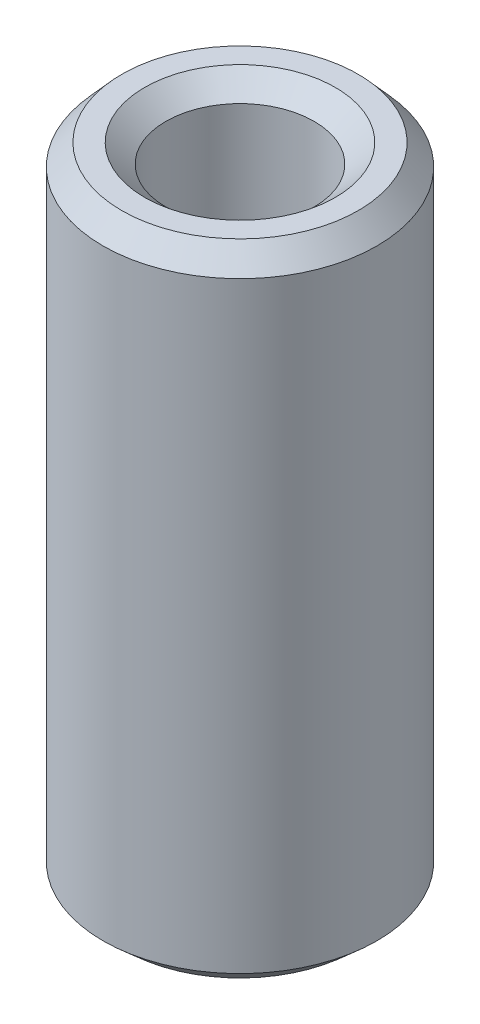
ISO-10303-21;
HEADER;
FILE_DESCRIPTION(('STEP AP214'),'2;1');
FILE_NAME('part.step','',(''),(''),'','','');
FILE_SCHEMA(('AUTOMOTIVE_DESIGN { 1 0 10303 214 1 1 1 1 }'));
ENDSEC;
DATA;
#1=APPLICATION_CONTEXT('core data for automotive mechanical design processes');
#2=APPLICATION_PROTOCOL_DEFINITION('international standard','automotive_design',2000,#1);
#3=PRODUCT_CONTEXT('',#1,'mechanical');
#4=PRODUCT('Part','Part','',(#3));
#5=PRODUCT_RELATED_PRODUCT_CATEGORY('part','',(#4));
#6=PRODUCT_DEFINITION_FORMATION('','',#4);
#7=PRODUCT_DEFINITION_CONTEXT('part definition',#1,'design');
#8=PRODUCT_DEFINITION('design','',#6,#7);
#9=PRODUCT_DEFINITION_SHAPE('','',#8);
#10=(LENGTH_UNIT() NAMED_UNIT(*) SI_UNIT(.MILLI.,.METRE.));
#11=(NAMED_UNIT(*) PLANE_ANGLE_UNIT() SI_UNIT($,.RADIAN.));
#12=(NAMED_UNIT(*) SI_UNIT($,.STERADIAN.) SOLID_ANGLE_UNIT());
#13=UNCERTAINTY_MEASURE_WITH_UNIT(LENGTH_MEASURE(1.E-05),#10,'distance_accuracy_value','');
#14=(GEOMETRIC_REPRESENTATION_CONTEXT(3) GLOBAL_UNCERTAINTY_ASSIGNED_CONTEXT((#13)) GLOBAL_UNIT_ASSIGNED_CONTEXT((#10,
#11,#12)) REPRESENTATION_CONTEXT('',''));
#15=CARTESIAN_POINT('',(0.,0.,0.));
#16=DIRECTION('',(0.,0.,1.));
#17=DIRECTION('',(1.,0.,0.));
#18=AXIS2_PLACEMENT_3D('',#15,#16,#17);
#19=CARTESIAN_POINT('',(0.,93.7116540600208,0.));
#20=DIRECTION('',(0.,-1.,0.));
#21=DIRECTION('',(0.,0.,-1.));
#22=AXIS2_PLACEMENT_3D('',#19,#20,#21);
#23=CYLINDRICAL_SURFACE('',#22,20.);
#24=CARTESIAN_POINT('',(0.,2.74448463937486,0.));
#25=DIRECTION('',(0.,1.,0.));
#26=DIRECTION('',(0.,0.,1.));
#27=AXIS2_PLACEMENT_3D('',#24,#25,#26);
#28=CIRCLE('',#27,20.);
#29=CARTESIAN_POINT('',(0.,2.74448463937486,20.));
#30=VERTEX_POINT('',#29);
#31=EDGE_CURVE('E10',#30,#30,#28,.T.);
#32=ORIENTED_EDGE('',*,*,#31,.T.);
#33=EDGE_LOOP('',(#32));
#34=FACE_BOUND('',#33,.T.);
#35=CARTESIAN_POINT('',(0.,90.6195021593534,0.));
#36=DIRECTION('',(0.,1.,0.));
#37=DIRECTION('',(0.,0.,1.));
#38=AXIS2_PLACEMENT_3D('',#35,#36,#37);
#39=CIRCLE('',#38,20.);
#40=CARTESIAN_POINT('',(0.,90.6195021593534,20.));
#41=VERTEX_POINT('',#40);
#42=EDGE_CURVE('E50',#41,#41,#39,.F.);
#43=ORIENTED_EDGE('',*,*,#42,.T.);
#44=EDGE_LOOP('',(#43));
#45=FACE_BOUND('',#44,.T.);
#46=ADVANCED_FACE('F39',(#34,#45),#23,.T.);
#47=CARTESIAN_POINT('',(0.,93.7116540600208,0.));
#48=DIRECTION('',(0.,1.,0.));
#49=DIRECTION('',(0.,0.,1.));
#50=AXIS2_PLACEMENT_3D('',#47,#48,#49);
#51=PLANE('',#50);
#52=CARTESIAN_POINT('',(0.,93.7116540600208,0.));
#53=DIRECTION('',(0.,1.,0.));
#54=DIRECTION('',(0.,0.,1.));
#55=AXIS2_PLACEMENT_3D('',#52,#53,#54);
#56=CIRCLE('',#55,13.9219117868472);
#57=CARTESIAN_POINT('',(0.,93.7116540600208,13.9219117868472));
#58=VERTEX_POINT('',#57);
#59=EDGE_CURVE('E58',#58,#58,#56,.F.);
#60=ORIENTED_EDGE('',*,*,#59,.T.);
#61=EDGE_LOOP('',(#60));
#62=FACE_BOUND('',#61,.T.);
#63=CARTESIAN_POINT('',(0.,93.7116540600208,0.));
#64=DIRECTION('',(0.,1.,0.));
#65=DIRECTION('',(0.,0.,1.));
#66=AXIS2_PLACEMENT_3D('',#63,#64,#65);
#67=CIRCLE('',#66,17.2555153606251);
#68=CARTESIAN_POINT('',(0.,93.7116540600208,17.2555153606251));
#69=VERTEX_POINT('',#68);
#70=EDGE_CURVE('E61',#69,#69,#67,.T.);
#71=ORIENTED_EDGE('',*,*,#70,.T.);
#72=EDGE_LOOP('',(#71));
#73=FACE_BOUND('',#72,.T.);
#74=ADVANCED_FACE('F88',(#62,#73),#51,.T.);
#75=CARTESIAN_POINT('',(0.,0.,0.));
#76=DIRECTION('',(0.,1.,0.));
#77=DIRECTION('',(0.,0.,1.));
#78=AXIS2_PLACEMENT_3D('',#75,#76,#77);
#79=PLANE('',#78);
#80=CARTESIAN_POINT('',(0.,0.,0.));
#81=DIRECTION('',(0.,1.,0.));
#82=DIRECTION('',(0.,0.,1.));
#83=AXIS2_PLACEMENT_3D('',#80,#81,#82);
#84=CIRCLE('',#83,13.5742445255546);
#85=CARTESIAN_POINT('',(0.,0.,-13.5742445255546));
#86=VERTEX_POINT('',#85);
#87=EDGE_CURVE('E51',#86,#86,#84,.T.);
#88=ORIENTED_EDGE('',*,*,#87,.T.);
#89=EDGE_LOOP('',(#88));
#90=FACE_BOUND('',#89,.T.);
#91=CARTESIAN_POINT('',(0.,0.,0.));
#92=DIRECTION('',(0.,1.,0.));
#93=DIRECTION('',(0.,0.,1.));
#94=AXIS2_PLACEMENT_3D('',#91,#92,#93);
#95=CIRCLE('',#94,16.9078480993326);
#96=CARTESIAN_POINT('',(0.,0.,16.9078480993326));
#97=VERTEX_POINT('',#96);
#98=EDGE_CURVE('E54',#97,#97,#95,.F.);
#99=ORIENTED_EDGE('',*,*,#98,.T.);
#100=EDGE_LOOP('',(#99));
#101=FACE_BOUND('',#100,.T.);
#102=ADVANCED_FACE('F83',(#90,#101),#79,.F.);
#103=CARTESIAN_POINT('',(0.,93.7116540600208,0.));
#104=DIRECTION('',(0.,-1.,0.));
#105=DIRECTION('',(0.,0.,-1.));
#106=AXIS2_PLACEMENT_3D('',#103,#104,#105);
#107=CYLINDRICAL_SURFACE('',#106,10.8297598861798);
#108=CARTESIAN_POINT('',(0.,90.9671694206459,0.));
#109=DIRECTION('',(0.,1.,0.));
#110=DIRECTION('',(0.,0.,1.));
#111=AXIS2_PLACEMENT_3D('',#108,#109,#110);
#112=CIRCLE('',#111,10.8297598861798);
#113=CARTESIAN_POINT('',(0.,90.9671694206459,10.8297598861798));
#114=VERTEX_POINT('',#113);
#115=EDGE_CURVE('E67',#114,#114,#112,.T.);
#116=ORIENTED_EDGE('',*,*,#115,.T.);
#117=EDGE_LOOP('',(#116));
#118=FACE_BOUND('',#117,.T.);
#119=CARTESIAN_POINT('',(0.,3.09215190066736,0.));
#120=DIRECTION('',(0.,1.,0.));
#121=DIRECTION('',(0.,0.,1.));
#122=AXIS2_PLACEMENT_3D('',#119,#120,#121);
#123=CIRCLE('',#122,10.8297598861798);
#124=CARTESIAN_POINT('',(0.,3.09215190066736,-10.8297598861798));
#125=VERTEX_POINT('',#124);
#126=EDGE_CURVE('E69',#125,#125,#123,.F.);
#127=ORIENTED_EDGE('',*,*,#126,.T.);
#128=EDGE_LOOP('',(#127));
#129=FACE_BOUND('',#128,.T.);
#130=ADVANCED_FACE('F71',(#118,#129),#107,.F.);
#131=CARTESIAN_POINT('',(0.,90.9671694206459,0.));
#132=DIRECTION('',(0.,1.,0.));
#133=DIRECTION('',(0.,0.,1.));
#134=AXIS2_PLACEMENT_3D('',#131,#132,#133);
#135=CONICAL_SURFACE('',#134,10.8297598861798,0.844894234450015);
#136=ORIENTED_EDGE('',*,*,#59,.F.);
#137=EDGE_LOOP('',(#136));
#138=FACE_BOUND('',#137,.T.);
#139=ORIENTED_EDGE('',*,*,#115,.F.);
#140=EDGE_LOOP('',(#139));
#141=FACE_BOUND('',#140,.T.);
#142=ADVANCED_FACE('F77',(#138,#141),#135,.F.);
#143=CARTESIAN_POINT('',(0.,0.,0.));
#144=DIRECTION('',(0.,-1.,0.));
#145=DIRECTION('',(0.,0.,-1.));
#146=AXIS2_PLACEMENT_3D('',#143,#144,#145);
#147=CONICAL_SURFACE('',#146,13.5742445255546,0.725902092344883);
#148=CARTESIAN_POINT('',(0.,3.09215190066736,-10.8297598861798));
#149=CARTESIAN_POINT('',(0.,3.05994198503541,-10.85834826784));
#150=CARTESIAN_POINT('',(0.,3.02773206940346,-10.8869366495001));
#151=CARTESIAN_POINT('',(0.,2.96331223813955,-10.9441134128204));
#152=CARTESIAN_POINT('',(0.,2.9311023225076,-10.9727017944806));
#153=CARTESIAN_POINT('',(0.,2.8666824912437,-11.0298785578009));
#154=CARTESIAN_POINT('',(0.,2.83447257561175,-11.058466939461));
#155=CARTESIAN_POINT('',(0.,2.77005274434784,-11.1156437027814));
#156=CARTESIAN_POINT('',(0.,2.73784282871589,-11.1442320844415));
#157=CARTESIAN_POINT('',(0.,2.67342299745199,-11.2014088477618));
#158=CARTESIAN_POINT('',(0.,2.64121308182004,-11.229997229422));
#159=CARTESIAN_POINT('',(0.,2.57679325055613,-11.2871739927423));
#160=CARTESIAN_POINT('',(0.,2.54458333492418,-11.3157623744024));
#161=CARTESIAN_POINT('',(0.,2.48016350366028,-11.3729391377227));
#162=CARTESIAN_POINT('',(0.,2.44795358802833,-11.4015275193829));
#163=CARTESIAN_POINT('',(0.,2.38353375676442,-11.4587042827032));
#164=CARTESIAN_POINT('',(0.,2.35132384113247,-11.4872926643634));
#165=CARTESIAN_POINT('',(0.,2.28690400986857,-11.5444694276837));
#166=CARTESIAN_POINT('',(0.,2.25469409423662,-11.5730578093438));
#167=CARTESIAN_POINT('',(0.,2.19027426297271,-11.6302345726641));
#168=CARTESIAN_POINT('',(0.,2.15806434734076,-11.6588229543243));
#169=CARTESIAN_POINT('',(0.,2.09364451607686,-11.7159997176446));
#170=CARTESIAN_POINT('',(0.,2.06143460044491,-11.7445880993048));
#171=CARTESIAN_POINT('',(0.,1.997014769181,-11.8017648626251));
#172=CARTESIAN_POINT('',(0.,1.96480485354905,-11.8303532442852));
#173=CARTESIAN_POINT('',(0.,1.90038502228515,-11.8875300076055));
#174=CARTESIAN_POINT('',(0.,1.8681751066532,-11.9161183892657));
#175=CARTESIAN_POINT('',(0.,1.80375527538929,-11.973295152586));
#176=CARTESIAN_POINT('',(0.,1.77154535975734,-12.0018835342461));
#177=CARTESIAN_POINT('',(0.,1.70712552849344,-12.0590602975665));
#178=CARTESIAN_POINT('',(0.,1.67491561286149,-12.0876486792266));
#179=CARTESIAN_POINT('',(0.,1.61049578159758,-12.1448254425469));
#180=CARTESIAN_POINT('',(0.,1.57828586596563,-12.1734138242071));
#181=CARTESIAN_POINT('',(0.,1.51386603470173,-12.2305905875274));
#182=CARTESIAN_POINT('',(0.,1.48165611906978,-12.2591789691875));
#183=CARTESIAN_POINT('',(0.,1.41723628780587,-12.3163557325078));
#184=CARTESIAN_POINT('',(0.,1.38502637217392,-12.344944114168));
#185=CARTESIAN_POINT('',(0.,1.32060654091002,-12.4021208774883));
#186=CARTESIAN_POINT('',(0.,1.28839662527807,-12.4307092591485));
#187=CARTESIAN_POINT('',(0.,1.22397679401416,-12.4878860224688));
#188=CARTESIAN_POINT('',(0.,1.19176687838221,-12.5164744041289));
#189=CARTESIAN_POINT('',(0.,1.12734704711831,-12.5736511674492));
#190=CARTESIAN_POINT('',(0.,1.09513713148636,-12.6022395491094));
#191=CARTESIAN_POINT('',(0.,1.03071730022245,-12.6594163124297));
#192=CARTESIAN_POINT('',(0.,0.998507384590502,-12.6880046940899));
#193=CARTESIAN_POINT('',(0.,0.934087553326599,-12.7451814574102));
#194=CARTESIAN_POINT('',(0.,0.901877637694647,-12.7737698390703));
#195=CARTESIAN_POINT('',(0.,0.837457806430744,-12.8309466023906));
#196=CARTESIAN_POINT('',(0.,0.805247890798792,-12.8595349840508));
#197=CARTESIAN_POINT('',(0.,0.740828059534889,-12.9167117473711));
#198=CARTESIAN_POINT('',(0.,0.708618143902937,-12.9453001290312));
#199=CARTESIAN_POINT('',(0.,0.644198312639033,-13.0024768923516));
#200=CARTESIAN_POINT('',(0.,0.611988397007082,-13.0310652740117));
#201=CARTESIAN_POINT('',(0.,0.547568565743179,-13.088242037332));
#202=CARTESIAN_POINT('',(0.,0.515358650111227,-13.1168304189922));
#203=CARTESIAN_POINT('',(0.,0.450938818847324,-13.1740071823125));
#204=CARTESIAN_POINT('',(0.,0.418728903215372,-13.2025955639726));
#205=CARTESIAN_POINT('',(0.,0.354309071951468,-13.2597723272929));
#206=CARTESIAN_POINT('',(0.,0.322099156319517,-13.2883607089531));
#207=CARTESIAN_POINT('',(0.,0.257679325055613,-13.3455374722734));
#208=CARTESIAN_POINT('',(0.,0.225469409423662,-13.3741258539336));
#209=CARTESIAN_POINT('',(0.,0.161049578159759,-13.4313026172539));
#210=CARTESIAN_POINT('',(0.,0.128839662527807,-13.459890998914));
#211=CARTESIAN_POINT('',(0.,0.0644198312639032,-13.5170677622343));
#212=CARTESIAN_POINT('',(0.,0.0322099156319514,-13.5456561438945));
#213=CARTESIAN_POINT('',(0.,0.,-13.5742445255546));
#214=B_SPLINE_CURVE_WITH_KNOTS('',3,(#148,#149,#150,#151,#152,#153,#154,#155,#156,#157,#158,
#159,#160,#161,#162,#163,#164,#165,#166,#167,#168,#169,#170,#171,#172,#173,#174,#175,#176,#177,
#178,#179,#180,#181,#182,#183,#184,#185,#186,#187,#188,#189,#190,#191,#192,#193,#194,#195,#196,
#197,#198,#199,#200,#201,#202,#203,#204,#205,#206,#207,#208,#209,#210,#211,#212,#213),
.UNSPECIFIED.,.F.,.F.,(4,2,2,2,2,2,2,2,2,2,2,2,2,2,2,2,2,2,2,2,2,2,2,2,2,2,2,2,2,2,2,2,4),(0.,
0.129201269648084,0.258402539296168,0.387603808944253,0.516805078592337,0.64600634824042,
0.775207617888504,0.904408887536589,1.03361015718467,1.16281142683276,1.29201269648084,
1.42121396612892,1.55041523577701,1.67961650542509,1.80881777507318,1.93801904472126,
2.06722031436935,2.19642158401743,2.32562285366551,2.4548241233136,2.58402539296168,
2.71322666260977,2.84242793225785,2.97162920190593,3.10083047155402,3.2300317412021,
3.35923301085019,3.48843428049827,3.61763555014635,3.74683681979444,3.87603808944252,
4.00523935909061,4.13444062873869),.UNSPECIFIED.);
#215=EDGE_CURVE('BSEAM73',#125,#86,#214,.T.);
#216=ORIENTED_EDGE('',*,*,#126,.F.);
#217=ORIENTED_EDGE('',*,*,#87,.F.);
#218=ORIENTED_EDGE('',*,*,#215,.T.);
#219=ORIENTED_EDGE('',*,*,#215,.F.);
#220=EDGE_LOOP('',(#216,#218,#217,#219));
#221=FACE_BOUND('',#220,.T.);
#222=ADVANCED_FACE('F73',(#221),#147,.F.);
#223=CARTESIAN_POINT('',(0.,2.74448463937486,0.));
#224=DIRECTION('',(0.,1.,0.));
#225=DIRECTION('',(0.,0.,1.));
#226=AXIS2_PLACEMENT_3D('',#223,#224,#225);
#227=CONICAL_SURFACE('',#226,20.,0.844894234450012);
#228=ORIENTED_EDGE('',*,*,#98,.F.);
#229=EDGE_LOOP('',(#228));
#230=FACE_BOUND('',#229,.T.);
#231=ORIENTED_EDGE('',*,*,#31,.F.);
#232=EDGE_LOOP('',(#231));
#233=FACE_BOUND('',#232,.T.);
#234=ADVANCED_FACE('F76',(#230,#233),#227,.T.);
#235=CARTESIAN_POINT('',(0.,93.7116540600208,0.));
#236=DIRECTION('',(0.,-1.,0.));
#237=DIRECTION('',(0.,0.,-1.));
#238=AXIS2_PLACEMENT_3D('',#235,#236,#237);
#239=CONICAL_SURFACE('',#238,17.2555153606251,0.725902092344886);
#240=ORIENTED_EDGE('',*,*,#42,.F.);
#241=EDGE_LOOP('',(#240));
#242=FACE_BOUND('',#241,.T.);
#243=ORIENTED_EDGE('',*,*,#70,.F.);
#244=EDGE_LOOP('',(#243));
#245=FACE_BOUND('',#244,.T.);
#246=ADVANCED_FACE('F45',(#242,#245),#239,.T.);
#247=CLOSED_SHELL('',(#46,#74,#102,#130,#142,#222,#234,#246));
#248=MANIFOLD_SOLID_BREP('B2',#247);
#249=ADVANCED_BREP_SHAPE_REPRESENTATION('',(#18,#248),#14);
#250=SHAPE_DEFINITION_REPRESENTATION(#9,#249);
ENDSEC;
END-ISO-10303-21;
